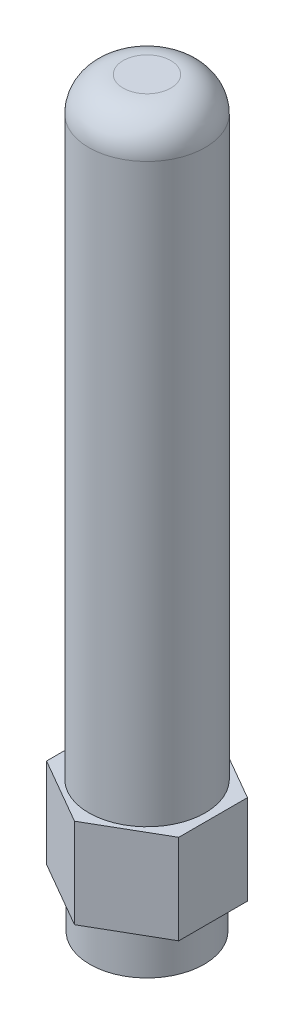
ISO-10303-21;
HEADER;
FILE_DESCRIPTION(('STEP AP214'),'2;1');
FILE_NAME('part.step','',(''),(''),'','','');
FILE_SCHEMA(('AUTOMOTIVE_DESIGN { 1 0 10303 214 1 1 1 1 }'));
ENDSEC;
DATA;
#1=APPLICATION_CONTEXT('core data for automotive mechanical design processes');
#2=APPLICATION_PROTOCOL_DEFINITION('international standard','automotive_design',2000,#1);
#3=PRODUCT_CONTEXT('',#1,'mechanical');
#4=PRODUCT('Part','Part','',(#3));
#5=PRODUCT_RELATED_PRODUCT_CATEGORY('part','',(#4));
#6=PRODUCT_DEFINITION_FORMATION('','',#4);
#7=PRODUCT_DEFINITION_CONTEXT('part definition',#1,'design');
#8=PRODUCT_DEFINITION('design','',#6,#7);
#9=PRODUCT_DEFINITION_SHAPE('','',#8);
#10=(LENGTH_UNIT() NAMED_UNIT(*) SI_UNIT(.MILLI.,.METRE.));
#11=(NAMED_UNIT(*) PLANE_ANGLE_UNIT() SI_UNIT($,.RADIAN.));
#12=(NAMED_UNIT(*) SI_UNIT($,.STERADIAN.) SOLID_ANGLE_UNIT());
#13=UNCERTAINTY_MEASURE_WITH_UNIT(LENGTH_MEASURE(1.E-05),#10,'distance_accuracy_value','');
#14=(GEOMETRIC_REPRESENTATION_CONTEXT(3) GLOBAL_UNCERTAINTY_ASSIGNED_CONTEXT((#13)) GLOBAL_UNIT_ASSIGNED_CONTEXT((#10,
#11,#12)) REPRESENTATION_CONTEXT('',''));
#15=CARTESIAN_POINT('',(0.,0.,0.));
#16=DIRECTION('',(0.,0.,1.));
#17=DIRECTION('',(1.,0.,0.));
#18=AXIS2_PLACEMENT_3D('',#15,#16,#17);
#19=CARTESIAN_POINT('',(0.,0.,0.));
#20=DIRECTION('',(0.,1.,0.));
#21=DIRECTION('',(0.,0.,1.));
#22=AXIS2_PLACEMENT_3D('',#19,#20,#21);
#23=PLANE('',#22);
#24=CARTESIAN_POINT('',(0.,0.,0.));
#25=DIRECTION('',(0.,1.,0.));
#26=DIRECTION('',(0.,0.,1.));
#27=AXIS2_PLACEMENT_3D('',#24,#25,#26);
#28=CIRCLE('',#27,3.81);
#29=CARTESIAN_POINT('',(0.,0.,3.81));
#30=VERTEX_POINT('',#29);
#31=EDGE_CURVE('E158',#30,#30,#28,.T.);
#32=ORIENTED_EDGE('',*,*,#31,.F.);
#33=EDGE_LOOP('',(#32));
#34=FACE_BOUND('',#33,.T.);
#35=CARTESIAN_POINT('',(0.,0.,0.));
#36=DIRECTION('',(0.,1.,0.));
#37=DIRECTION('',(0.,0.,1.));
#38=AXIS2_PLACEMENT_3D('',#35,#36,#37);
#39=CIRCLE('',#38,2.667);
#40=CARTESIAN_POINT('',(0.,0.,2.667));
#41=VERTEX_POINT('',#40);
#42=EDGE_CURVE('E155',#41,#41,#39,.T.);
#43=ORIENTED_EDGE('',*,*,#42,.T.);
#44=EDGE_LOOP('',(#43));
#45=FACE_BOUND('',#44,.T.);
#46=ADVANCED_FACE('F47',(#34,#45),#23,.F.);
#47=CARTESIAN_POINT('',(0.,2.794,0.));
#48=DIRECTION('',(0.,-1.,0.));
#49=DIRECTION('',(0.,0.,-1.));
#50=AXIS2_PLACEMENT_3D('',#47,#48,#49);
#51=CYLINDRICAL_SURFACE('',#50,3.81);
#52=CARTESIAN_POINT('',(0.,2.794,0.));
#53=DIRECTION('',(0.,1.,0.));
#54=DIRECTION('',(0.,0.,1.));
#55=AXIS2_PLACEMENT_3D('',#52,#53,#54);
#56=CIRCLE('',#55,3.81);
#57=CARTESIAN_POINT('',(0.,2.794,3.81));
#58=VERTEX_POINT('',#57);
#59=EDGE_CURVE('E159',#58,#58,#56,.T.);
#60=ORIENTED_EDGE('',*,*,#59,.F.);
#61=EDGE_LOOP('',(#60));
#62=FACE_BOUND('',#61,.T.);
#63=ORIENTED_EDGE('',*,*,#31,.T.);
#64=EDGE_LOOP('',(#63));
#65=FACE_BOUND('',#64,.T.);
#66=ADVANCED_FACE('F196',(#62,#65),#51,.T.);
#67=CARTESIAN_POINT('',(0.,2.794,0.));
#68=DIRECTION('',(0.,-1.,0.));
#69=DIRECTION('',(0.,0.,-1.));
#70=AXIS2_PLACEMENT_3D('',#67,#68,#69);
#71=CYLINDRICAL_SURFACE('',#70,2.667);
#72=CARTESIAN_POINT('',(0.,2.794,0.));
#73=DIRECTION('',(0.,1.,0.));
#74=DIRECTION('',(0.,0.,1.));
#75=AXIS2_PLACEMENT_3D('',#72,#73,#74);
#76=CIRCLE('',#75,2.667);
#77=CARTESIAN_POINT('',(0.,2.794,2.667));
#78=VERTEX_POINT('',#77);
#79=EDGE_CURVE('E152',#78,#78,#76,.T.);
#80=ORIENTED_EDGE('',*,*,#79,.T.);
#81=EDGE_LOOP('',(#80));
#82=FACE_BOUND('',#81,.T.);
#83=ORIENTED_EDGE('',*,*,#42,.F.);
#84=EDGE_LOOP('',(#83));
#85=FACE_BOUND('',#84,.T.);
#86=ADVANCED_FACE('F202',(#82,#85),#71,.F.);
#87=CARTESIAN_POINT('',(0.,2.794,0.));
#88=DIRECTION('',(0.,1.,0.));
#89=DIRECTION('',(0.,0.,1.));
#90=AXIS2_PLACEMENT_3D('',#87,#88,#89);
#91=PLANE('',#90);
#92=ORIENTED_EDGE('',*,*,#79,.F.);
#93=EDGE_LOOP('',(#92));
#94=FACE_BOUND('',#93,.T.);
#95=ADVANCED_FACE('F209',(#94),#91,.F.);
#96=CARTESIAN_POINT('',(-4.39940905122496,8.763,-2.286));
#97=DIRECTION('',(0.499999999999998,0.,0.86602540378444));
#98=DIRECTION('',(0.86602540378444,0.,-0.499999999999998));
#99=AXIS2_PLACEMENT_3D('',#96,#97,#98);
#100=PLANE('',#99);
#101=DIRECTION('',(-0.86602540378444,0.,0.499999999999998));
#102=VECTOR('',#101,1.);
#103=CARTESIAN_POINT('',(-4.39940905122496,2.794,-2.286));
#104=LINE('',#103,#102);
#105=CARTESIAN_POINT('',(0.,2.794,-4.82599999999999));
#106=VERTEX_POINT('',#105);
#107=CARTESIAN_POINT('',(-4.39940905122496,2.794,-2.286));
#108=VERTEX_POINT('',#107);
#109=EDGE_CURVE('E133',#106,#108,#104,.T.);
#110=ORIENTED_EDGE('',*,*,#109,.T.);
#111=DIRECTION('',(0.,-1.,0.));
#112=VECTOR('',#111,1.);
#113=CARTESIAN_POINT('',(-4.39940905122496,8.763,-2.286));
#114=LINE('',#113,#112);
#115=CARTESIAN_POINT('',(-4.39940905122496,8.763,-2.286));
#116=VERTEX_POINT('',#115);
#117=EDGE_CURVE('E150',#116,#108,#114,.T.);
#118=ORIENTED_EDGE('',*,*,#117,.F.);
#119=DIRECTION('',(-0.86602540378444,0.,0.499999999999998));
#120=VECTOR('',#119,1.);
#121=CARTESIAN_POINT('',(-4.39940905122496,8.763,-2.286));
#122=LINE('',#121,#120);
#123=CARTESIAN_POINT('',(0.,8.763,-4.82599999999999));
#124=VERTEX_POINT('',#123);
#125=EDGE_CURVE('E143',#124,#116,#122,.T.);
#126=ORIENTED_EDGE('',*,*,#125,.F.);
#127=DIRECTION('',(0.,-1.,0.));
#128=VECTOR('',#127,1.);
#129=CARTESIAN_POINT('',(0.,8.763,-4.82599999999999));
#130=LINE('',#129,#128);
#131=EDGE_CURVE('E129',#124,#106,#130,.T.);
#132=ORIENTED_EDGE('',*,*,#131,.T.);
#133=EDGE_LOOP('',(#110,#118,#126,#132));
#134=FACE_BOUND('',#133,.T.);
#135=ADVANCED_FACE('F183',(#134),#100,.F.);
#136=CARTESIAN_POINT('',(-4.39940905122496,8.763,2.286));
#137=DIRECTION('',(1.,0.,0.));
#138=DIRECTION('',(0.,0.,-1.));
#139=AXIS2_PLACEMENT_3D('',#136,#137,#138);
#140=PLANE('',#139);
#141=DIRECTION('',(0.,0.,1.));
#142=VECTOR('',#141,1.);
#143=CARTESIAN_POINT('',(-4.39940905122496,2.794,2.286));
#144=LINE('',#143,#142);
#145=CARTESIAN_POINT('',(-4.39940905122496,2.794,2.286));
#146=VERTEX_POINT('',#145);
#147=EDGE_CURVE('E136',#108,#146,#144,.T.);
#148=ORIENTED_EDGE('',*,*,#147,.T.);
#149=DIRECTION('',(0.,-1.,0.));
#150=VECTOR('',#149,1.);
#151=CARTESIAN_POINT('',(-4.39940905122496,8.763,2.286));
#152=LINE('',#151,#150);
#153=CARTESIAN_POINT('',(-4.39940905122496,8.763,2.286));
#154=VERTEX_POINT('',#153);
#155=EDGE_CURVE('E147',#154,#146,#152,.T.);
#156=ORIENTED_EDGE('',*,*,#155,.F.);
#157=DIRECTION('',(0.,0.,1.));
#158=VECTOR('',#157,1.);
#159=CARTESIAN_POINT('',(-4.39940905122496,8.763,2.286));
#160=LINE('',#159,#158);
#161=EDGE_CURVE('E102',#116,#154,#160,.T.);
#162=ORIENTED_EDGE('',*,*,#161,.F.);
#163=ORIENTED_EDGE('',*,*,#117,.T.);
#164=EDGE_LOOP('',(#148,#156,#162,#163));
#165=FACE_BOUND('',#164,.T.);
#166=ADVANCED_FACE('F175',(#165),#140,.F.);
#167=CARTESIAN_POINT('',(-4.39940905122496,8.763,2.286));
#168=DIRECTION('',(0.499999999999998,0.,-0.86602540378444));
#169=DIRECTION('',(-0.86602540378444,0.,-0.499999999999998));
#170=AXIS2_PLACEMENT_3D('',#167,#168,#169);
#171=PLANE('',#170);
#172=DIRECTION('',(0.86602540378444,0.,0.499999999999998));
#173=VECTOR('',#172,1.);
#174=CARTESIAN_POINT('',(-4.39940905122496,2.794,2.286));
#175=LINE('',#174,#173);
#176=CARTESIAN_POINT('',(0.,2.794,4.82599999999999));
#177=VERTEX_POINT('',#176);
#178=EDGE_CURVE('E138',#146,#177,#175,.T.);
#179=ORIENTED_EDGE('',*,*,#178,.T.);
#180=DIRECTION('',(0.,-1.,0.));
#181=VECTOR('',#180,1.);
#182=CARTESIAN_POINT('',(0.,8.763,4.82599999999999));
#183=LINE('',#182,#181);
#184=CARTESIAN_POINT('',(0.,8.763,4.82599999999999));
#185=VERTEX_POINT('',#184);
#186=EDGE_CURVE('E124',#185,#177,#183,.T.);
#187=ORIENTED_EDGE('',*,*,#186,.F.);
#188=DIRECTION('',(0.86602540378444,0.,0.499999999999998));
#189=VECTOR('',#188,1.);
#190=CARTESIAN_POINT('',(-4.39940905122496,8.763,2.286));
#191=LINE('',#190,#189);
#192=EDGE_CURVE('E115',#154,#185,#191,.T.);
#193=ORIENTED_EDGE('',*,*,#192,.F.);
#194=ORIENTED_EDGE('',*,*,#155,.T.);
#195=EDGE_LOOP('',(#179,#187,#193,#194));
#196=FACE_BOUND('',#195,.T.);
#197=ADVANCED_FACE('F178',(#196),#171,.F.);
#198=CARTESIAN_POINT('',(4.39940905122496,8.763,2.286));
#199=DIRECTION('',(-0.499999999999998,0.,-0.86602540378444));
#200=DIRECTION('',(-0.86602540378444,0.,0.499999999999998));
#201=AXIS2_PLACEMENT_3D('',#198,#199,#200);
#202=PLANE('',#201);
#203=DIRECTION('',(0.86602540378444,0.,-0.499999999999998));
#204=VECTOR('',#203,1.);
#205=CARTESIAN_POINT('',(4.39940905122496,2.794,2.286));
#206=LINE('',#205,#204);
#207=CARTESIAN_POINT('',(4.39940905122496,2.794,2.286));
#208=VERTEX_POINT('',#207);
#209=EDGE_CURVE('E123',#177,#208,#206,.T.);
#210=ORIENTED_EDGE('',*,*,#209,.T.);
#211=DIRECTION('',(0.,-1.,0.));
#212=VECTOR('',#211,1.);
#213=CARTESIAN_POINT('',(4.39940905122496,8.763,2.286));
#214=LINE('',#213,#212);
#215=CARTESIAN_POINT('',(4.39940905122496,8.763,2.286));
#216=VERTEX_POINT('',#215);
#217=EDGE_CURVE('E120',#216,#208,#214,.T.);
#218=ORIENTED_EDGE('',*,*,#217,.F.);
#219=DIRECTION('',(0.86602540378444,0.,-0.499999999999998));
#220=VECTOR('',#219,1.);
#221=CARTESIAN_POINT('',(4.39940905122496,8.763,2.286));
#222=LINE('',#221,#220);
#223=EDGE_CURVE('E109',#185,#216,#222,.T.);
#224=ORIENTED_EDGE('',*,*,#223,.F.);
#225=ORIENTED_EDGE('',*,*,#186,.T.);
#226=EDGE_LOOP('',(#210,#218,#224,#225));
#227=FACE_BOUND('',#226,.T.);
#228=ADVANCED_FACE('F121',(#227),#202,.F.);
#229=CARTESIAN_POINT('',(4.39940905122496,8.763,2.286));
#230=DIRECTION('',(-1.,0.,0.));
#231=DIRECTION('',(0.,0.,1.));
#232=AXIS2_PLACEMENT_3D('',#229,#230,#231);
#233=PLANE('',#232);
#234=DIRECTION('',(0.,0.,-1.));
#235=VECTOR('',#234,1.);
#236=CARTESIAN_POINT('',(4.39940905122496,2.794,2.286));
#237=LINE('',#236,#235);
#238=CARTESIAN_POINT('',(4.39940905122496,2.794,-2.286));
#239=VERTEX_POINT('',#238);
#240=EDGE_CURVE('E87',#208,#239,#237,.T.);
#241=ORIENTED_EDGE('',*,*,#240,.T.);
#242=DIRECTION('',(0.,-1.,0.));
#243=VECTOR('',#242,1.);
#244=CARTESIAN_POINT('',(4.39940905122496,8.763,-2.286));
#245=LINE('',#244,#243);
#246=CARTESIAN_POINT('',(4.39940905122496,8.763,-2.286));
#247=VERTEX_POINT('',#246);
#248=EDGE_CURVE('E125',#247,#239,#245,.T.);
#249=ORIENTED_EDGE('',*,*,#248,.F.);
#250=DIRECTION('',(0.,0.,-1.));
#251=VECTOR('',#250,1.);
#252=CARTESIAN_POINT('',(4.39940905122496,8.763,2.286));
#253=LINE('',#252,#251);
#254=EDGE_CURVE('E113',#216,#247,#253,.T.);
#255=ORIENTED_EDGE('',*,*,#254,.F.);
#256=ORIENTED_EDGE('',*,*,#217,.T.);
#257=EDGE_LOOP('',(#241,#249,#255,#256));
#258=FACE_BOUND('',#257,.T.);
#259=ADVANCED_FACE('F127',(#258),#233,.F.);
#260=CARTESIAN_POINT('',(4.39940905122496,8.763,-2.286));
#261=DIRECTION('',(-0.499999999999998,0.,0.86602540378444));
#262=DIRECTION('',(0.86602540378444,0.,0.499999999999998));
#263=AXIS2_PLACEMENT_3D('',#260,#261,#262);
#264=PLANE('',#263);
#265=DIRECTION('',(-0.86602540378444,0.,-0.499999999999998));
#266=VECTOR('',#265,1.);
#267=CARTESIAN_POINT('',(4.39940905122496,2.794,-2.286));
#268=LINE('',#267,#266);
#269=EDGE_CURVE('E93',#239,#106,#268,.T.);
#270=ORIENTED_EDGE('',*,*,#269,.T.);
#271=ORIENTED_EDGE('',*,*,#131,.F.);
#272=DIRECTION('',(-0.86602540378444,0.,-0.499999999999998));
#273=VECTOR('',#272,1.);
#274=CARTESIAN_POINT('',(4.39940905122496,8.763,-2.286));
#275=LINE('',#274,#273);
#276=EDGE_CURVE('E64',#247,#124,#275,.T.);
#277=ORIENTED_EDGE('',*,*,#276,.F.);
#278=ORIENTED_EDGE('',*,*,#248,.T.);
#279=EDGE_LOOP('',(#270,#271,#277,#278));
#280=FACE_BOUND('',#279,.T.);
#281=ADVANCED_FACE('F184',(#280),#264,.F.);
#282=CARTESIAN_POINT('',(0.,8.763,0.));
#283=DIRECTION('',(0.,1.,0.));
#284=DIRECTION('',(0.,0.,1.));
#285=AXIS2_PLACEMENT_3D('',#282,#283,#284);
#286=PLANE('',#285);
#287=CARTESIAN_POINT('',(0.,8.763,0.));
#288=DIRECTION('',(0.,1.,0.));
#289=DIRECTION('',(0.,0.,1.));
#290=AXIS2_PLACEMENT_3D('',#287,#288,#289);
#291=CIRCLE('',#290,3.8735);
#292=CARTESIAN_POINT('',(0.,8.763,3.8735));
#293=VERTEX_POINT('',#292);
#294=EDGE_CURVE('E162',#293,#293,#291,.T.);
#295=ORIENTED_EDGE('',*,*,#294,.F.);
#296=EDGE_LOOP('',(#295));
#297=FACE_BOUND('',#296,.T.);
#298=ORIENTED_EDGE('',*,*,#125,.T.);
#299=ORIENTED_EDGE('',*,*,#161,.T.);
#300=ORIENTED_EDGE('',*,*,#192,.T.);
#301=ORIENTED_EDGE('',*,*,#223,.T.);
#302=ORIENTED_EDGE('',*,*,#254,.T.);
#303=ORIENTED_EDGE('',*,*,#276,.T.);
#304=EDGE_LOOP('',(#298,#299,#300,#301,#302,#303));
#305=FACE_BOUND('',#304,.T.);
#306=ADVANCED_FACE('F111',(#297,#305),#286,.T.);
#307=ORIENTED_EDGE('',*,*,#59,.T.);
#308=EDGE_LOOP('',(#307));
#309=FACE_BOUND('',#308,.T.);
#310=ORIENTED_EDGE('',*,*,#109,.F.);
#311=ORIENTED_EDGE('',*,*,#269,.F.);
#312=ORIENTED_EDGE('',*,*,#240,.F.);
#313=ORIENTED_EDGE('',*,*,#209,.F.);
#314=ORIENTED_EDGE('',*,*,#178,.F.);
#315=ORIENTED_EDGE('',*,*,#147,.F.);
#316=EDGE_LOOP('',(#310,#311,#312,#313,#314,#315));
#317=FACE_BOUND('',#316,.T.);
#318=ADVANCED_FACE('F181',(#309,#317),#91,.F.);
#319=CARTESIAN_POINT('',(0.,49.403,0.));
#320=DIRECTION('',(0.,-1.,0.));
#321=DIRECTION('',(0.,0.,-1.));
#322=AXIS2_PLACEMENT_3D('',#319,#320,#321);
#323=CYLINDRICAL_SURFACE('',#322,3.8735);
#324=CARTESIAN_POINT('',(0.,47.117,0.));
#325=DIRECTION('',(0.,1.,0.));
#326=DIRECTION('',(0.,0.,1.));
#327=AXIS2_PLACEMENT_3D('',#324,#325,#326);
#328=CIRCLE('',#327,3.8735);
#329=CARTESIAN_POINT('',(0.,47.117,3.8735));
#330=VERTEX_POINT('',#329);
#331=EDGE_CURVE('E11',#330,#330,#328,.F.);
#332=ORIENTED_EDGE('',*,*,#331,.T.);
#333=EDGE_LOOP('',(#332));
#334=FACE_BOUND('',#333,.T.);
#335=ORIENTED_EDGE('',*,*,#294,.T.);
#336=EDGE_LOOP('',(#335));
#337=FACE_BOUND('',#336,.T.);
#338=ADVANCED_FACE('F246',(#334,#337),#323,.T.);
#339=CARTESIAN_POINT('',(0.,49.403,0.));
#340=DIRECTION('',(0.,1.,0.));
#341=DIRECTION('',(0.,0.,1.));
#342=AXIS2_PLACEMENT_3D('',#339,#340,#341);
#343=PLANE('',#342);
#344=CARTESIAN_POINT('',(0.,49.403,0.));
#345=DIRECTION('',(0.,1.,0.));
#346=DIRECTION('',(0.,0.,1.));
#347=AXIS2_PLACEMENT_3D('',#344,#345,#346);
#348=CIRCLE('',#347,1.5875);
#349=CARTESIAN_POINT('',(0.,49.403,1.5875));
#350=VERTEX_POINT('',#349);
#351=EDGE_CURVE('E56',#350,#350,#348,.T.);
#352=ORIENTED_EDGE('',*,*,#351,.T.);
#353=EDGE_LOOP('',(#352));
#354=FACE_BOUND('',#353,.T.);
#355=ADVANCED_FACE('F254',(#354),#343,.T.);
#356=CARTESIAN_POINT('',(0.,47.117,0.));
#357=DIRECTION('',(0.,1.,0.));
#358=DIRECTION('',(0.,0.,1.));
#359=AXIS2_PLACEMENT_3D('',#356,#357,#358);
#360=DEGENERATE_TOROIDAL_SURFACE('',#359,1.5875,2.286,.T.);
#361=ORIENTED_EDGE('',*,*,#331,.F.);
#362=EDGE_LOOP('',(#361));
#363=FACE_BOUND('',#362,.T.);
#364=ORIENTED_EDGE('',*,*,#351,.F.);
#365=EDGE_LOOP('',(#364));
#366=FACE_BOUND('',#365,.T.);
#367=ADVANCED_FACE('F49',(#363,#366),#360,.T.);
#368=CLOSED_SHELL('',(#46,#66,#86,#95,#135,#166,#197,#228,#259,#281,#306,#318,#338,#355,#367));
#369=MANIFOLD_SOLID_BREP('B2',#368);
#370=ADVANCED_BREP_SHAPE_REPRESENTATION('',(#18,#369),#14);
#371=SHAPE_DEFINITION_REPRESENTATION(#9,#370);
ENDSEC;
END-ISO-10303-21;
